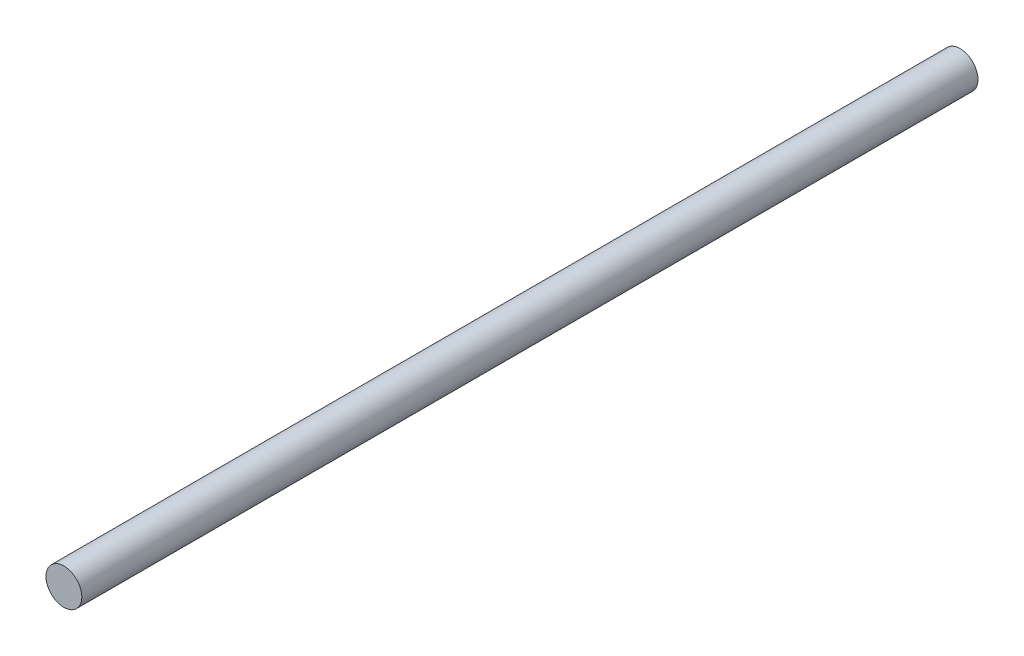
ISO-10303-21;
HEADER;
FILE_DESCRIPTION(('STEP AP214'),'2;1');
FILE_NAME('part.step','',(''),(''),'','','');
FILE_SCHEMA(('AUTOMOTIVE_DESIGN { 1 0 10303 214 1 1 1 1 }'));
ENDSEC;
DATA;
#1=APPLICATION_CONTEXT('core data for automotive mechanical design processes');
#2=APPLICATION_PROTOCOL_DEFINITION('international standard','automotive_design',2000,#1);
#3=PRODUCT_CONTEXT('',#1,'mechanical');
#4=PRODUCT('Part','Part','',(#3));
#5=PRODUCT_RELATED_PRODUCT_CATEGORY('part','',(#4));
#6=PRODUCT_DEFINITION_FORMATION('','',#4);
#7=PRODUCT_DEFINITION_CONTEXT('part definition',#1,'design');
#8=PRODUCT_DEFINITION('design','',#6,#7);
#9=PRODUCT_DEFINITION_SHAPE('','',#8);
#10=(LENGTH_UNIT() NAMED_UNIT(*) SI_UNIT(.MILLI.,.METRE.));
#11=(NAMED_UNIT(*) PLANE_ANGLE_UNIT() SI_UNIT($,.RADIAN.));
#12=(NAMED_UNIT(*) SI_UNIT($,.STERADIAN.) SOLID_ANGLE_UNIT());
#13=UNCERTAINTY_MEASURE_WITH_UNIT(LENGTH_MEASURE(1.E-05),#10,'distance_accuracy_value','');
#14=(GEOMETRIC_REPRESENTATION_CONTEXT(3) GLOBAL_UNCERTAINTY_ASSIGNED_CONTEXT((#13)) GLOBAL_UNIT_ASSIGNED_CONTEXT((#10,
#11,#12)) REPRESENTATION_CONTEXT('',''));
#15=CARTESIAN_POINT('',(0.,0.,0.));
#16=DIRECTION('',(0.,0.,1.));
#17=DIRECTION('',(1.,0.,0.));
#18=AXIS2_PLACEMENT_3D('',#15,#16,#17);
#19=CARTESIAN_POINT('',(0.,2.5,75.));
#20=DIRECTION('',(0.,0.,-1.));
#21=DIRECTION('',(-1.,0.,0.));
#22=AXIS2_PLACEMENT_3D('',#19,#20,#21);
#23=CYLINDRICAL_SURFACE('',#22,1.5);
#24=CARTESIAN_POINT('',(0.,2.5,75.));
#25=DIRECTION('',(0.,0.,1.));
#26=DIRECTION('',(1.,0.,0.));
#27=AXIS2_PLACEMENT_3D('',#24,#25,#26);
#28=CIRCLE('',#27,1.5);
#29=CARTESIAN_POINT('',(1.5,2.5,75.));
#30=VERTEX_POINT('',#29);
#31=EDGE_CURVE('E10',#30,#30,#28,.T.);
#32=ORIENTED_EDGE('',*,*,#31,.F.);
#33=EDGE_LOOP('',(#32));
#34=FACE_BOUND('',#33,.T.);
#35=CARTESIAN_POINT('',(0.,2.5,0.));
#36=DIRECTION('',(0.,0.,1.));
#37=DIRECTION('',(1.,0.,0.));
#38=AXIS2_PLACEMENT_3D('',#35,#36,#37);
#39=CIRCLE('',#38,1.5);
#40=CARTESIAN_POINT('',(1.5,2.5,0.));
#41=VERTEX_POINT('',#40);
#42=EDGE_CURVE('E36',#41,#41,#39,.T.);
#43=ORIENTED_EDGE('',*,*,#42,.T.);
#44=EDGE_LOOP('',(#43));
#45=FACE_BOUND('',#44,.T.);
#46=ADVANCED_FACE('F33',(#34,#45),#23,.T.);
#47=CARTESIAN_POINT('',(0.,2.5,75.));
#48=DIRECTION('',(0.,0.,1.));
#49=DIRECTION('',(1.,0.,0.));
#50=AXIS2_PLACEMENT_3D('',#47,#48,#49);
#51=PLANE('',#50);
#52=ORIENTED_EDGE('',*,*,#31,.T.);
#53=EDGE_LOOP('',(#52));
#54=FACE_BOUND('',#53,.T.);
#55=ADVANCED_FACE('F48',(#54),#51,.T.);
#56=CARTESIAN_POINT('',(0.,2.5,0.));
#57=DIRECTION('',(0.,0.,1.));
#58=DIRECTION('',(1.,0.,0.));
#59=AXIS2_PLACEMENT_3D('',#56,#57,#58);
#60=PLANE('',#59);
#61=ORIENTED_EDGE('',*,*,#42,.F.);
#62=EDGE_LOOP('',(#61));
#63=FACE_BOUND('',#62,.T.);
#64=ADVANCED_FACE('F46',(#63),#60,.F.);
#65=CLOSED_SHELL('',(#46,#55,#64));
#66=MANIFOLD_SOLID_BREP('B2',#65);
#67=ADVANCED_BREP_SHAPE_REPRESENTATION('',(#18,#66),#14);
#68=SHAPE_DEFINITION_REPRESENTATION(#9,#67);
ENDSEC;
END-ISO-10303-21;
